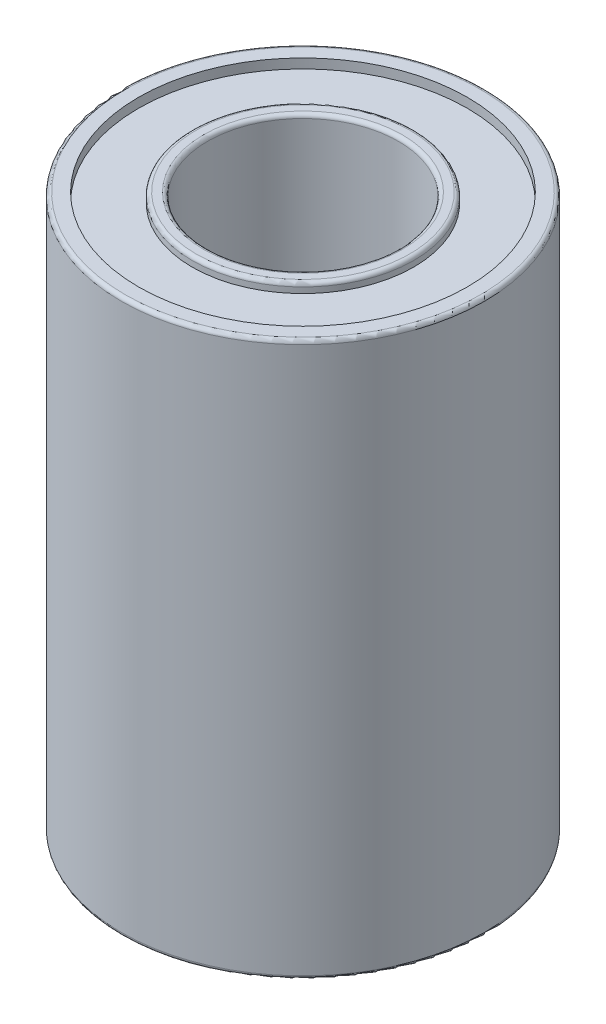
ISO-10303-21;
HEADER;
FILE_DESCRIPTION(('STEP AP214'),'2;1');
FILE_NAME('part.step','',(''),(''),'','','');
FILE_SCHEMA(('AUTOMOTIVE_DESIGN { 1 0 10303 214 1 1 1 1 }'));
ENDSEC;
DATA;
#1=APPLICATION_CONTEXT('core data for automotive mechanical design processes');
#2=APPLICATION_PROTOCOL_DEFINITION('international standard','automotive_design',2000,#1);
#3=PRODUCT_CONTEXT('',#1,'mechanical');
#4=PRODUCT('Part','Part','',(#3));
#5=PRODUCT_RELATED_PRODUCT_CATEGORY('part','',(#4));
#6=PRODUCT_DEFINITION_FORMATION('','',#4);
#7=PRODUCT_DEFINITION_CONTEXT('part definition',#1,'design');
#8=PRODUCT_DEFINITION('design','',#6,#7);
#9=PRODUCT_DEFINITION_SHAPE('','',#8);
#10=(LENGTH_UNIT() NAMED_UNIT(*) SI_UNIT(.MILLI.,.METRE.));
#11=(NAMED_UNIT(*) PLANE_ANGLE_UNIT() SI_UNIT($,.RADIAN.));
#12=(NAMED_UNIT(*) SI_UNIT($,.STERADIAN.) SOLID_ANGLE_UNIT());
#13=UNCERTAINTY_MEASURE_WITH_UNIT(LENGTH_MEASURE(1.E-05),#10,'distance_accuracy_value','');
#14=(GEOMETRIC_REPRESENTATION_CONTEXT(3) GLOBAL_UNCERTAINTY_ASSIGNED_CONTEXT((#13)) GLOBAL_UNIT_ASSIGNED_CONTEXT((#10,
#11,#12)) REPRESENTATION_CONTEXT('',''));
#15=CARTESIAN_POINT('',(0.,0.,0.));
#16=DIRECTION('',(0.,0.,1.));
#17=DIRECTION('',(1.,0.,0.));
#18=AXIS2_PLACEMENT_3D('',#15,#16,#17);
#19=CARTESIAN_POINT('',(0.,0.,0.));
#20=DIRECTION('',(0.,1.,0.));
#21=DIRECTION('',(0.,0.,1.));
#22=AXIS2_PLACEMENT_3D('',#19,#20,#21);
#23=PLANE('',#22);
#24=CARTESIAN_POINT('',(0.,0.,0.));
#25=DIRECTION('',(0.,1.,0.));
#26=DIRECTION('',(0.,0.,1.));
#27=AXIS2_PLACEMENT_3D('',#24,#25,#26);
#28=CIRCLE('',#27,5.2);
#29=CARTESIAN_POINT('',(0.,0.,5.2));
#30=VERTEX_POINT('',#29);
#31=EDGE_CURVE('E67',#30,#30,#28,.T.);
#32=ORIENTED_EDGE('',*,*,#31,.T.);
#33=EDGE_LOOP('',(#32));
#34=FACE_BOUND('',#33,.T.);
#35=CARTESIAN_POINT('',(0.,0.,0.));
#36=DIRECTION('',(0.,1.,0.));
#37=DIRECTION('',(0.,0.,1.));
#38=AXIS2_PLACEMENT_3D('',#35,#36,#37);
#39=CIRCLE('',#38,5.6);
#40=CARTESIAN_POINT('',(0.,0.,5.6));
#41=VERTEX_POINT('',#40);
#42=EDGE_CURVE('E70',#41,#41,#39,.F.);
#43=ORIENTED_EDGE('',*,*,#42,.T.);
#44=EDGE_LOOP('',(#43));
#45=FACE_BOUND('',#44,.T.);
#46=ADVANCED_FACE('F32',(#34,#45),#23,.F.);
#47=CARTESIAN_POINT('',(0.,29.,0.));
#48=DIRECTION('',(0.,1.,0.));
#49=DIRECTION('',(0.,0.,1.));
#50=AXIS2_PLACEMENT_3D('',#47,#48,#49);
#51=PLANE('',#50);
#52=CARTESIAN_POINT('',(0.,29.,0.));
#53=DIRECTION('',(0.,1.,0.));
#54=DIRECTION('',(0.,0.,1.));
#55=AXIS2_PLACEMENT_3D('',#52,#53,#54);
#56=CIRCLE('',#55,5.2);
#57=CARTESIAN_POINT('',(0.,29.,5.2));
#58=VERTEX_POINT('',#57);
#59=EDGE_CURVE('E39',#58,#58,#56,.F.);
#60=ORIENTED_EDGE('',*,*,#59,.T.);
#61=EDGE_LOOP('',(#60));
#62=FACE_BOUND('',#61,.T.);
#63=CARTESIAN_POINT('',(0.,29.,0.));
#64=DIRECTION('',(0.,1.,0.));
#65=DIRECTION('',(0.,0.,1.));
#66=AXIS2_PLACEMENT_3D('',#63,#64,#65);
#67=CIRCLE('',#66,5.6);
#68=CARTESIAN_POINT('',(0.,29.,5.6));
#69=VERTEX_POINT('',#68);
#70=EDGE_CURVE('E43',#69,#69,#67,.T.);
#71=ORIENTED_EDGE('',*,*,#70,.T.);
#72=EDGE_LOOP('',(#71));
#73=FACE_BOUND('',#72,.T.);
#74=ADVANCED_FACE('F118',(#62,#73),#51,.T.);
#75=CARTESIAN_POINT('',(0.,29.,0.));
#76=DIRECTION('',(0.,1.,0.));
#77=DIRECTION('',(0.,0.,1.));
#78=AXIS2_PLACEMENT_3D('',#75,#76,#77);
#79=CIRCLE('',#78,9.3);
#80=CARTESIAN_POINT('',(0.,29.,9.3));
#81=VERTEX_POINT('',#80);
#82=EDGE_CURVE('E79',#81,#81,#79,.T.);
#83=ORIENTED_EDGE('',*,*,#82,.T.);
#84=EDGE_LOOP('',(#83));
#85=FACE_BOUND('',#84,.T.);
#86=CARTESIAN_POINT('',(0.,29.,0.));
#87=DIRECTION('',(0.,1.,0.));
#88=DIRECTION('',(0.,0.,1.));
#89=AXIS2_PLACEMENT_3D('',#86,#87,#88);
#90=CIRCLE('',#89,8.6);
#91=CARTESIAN_POINT('',(0.,29.,8.6));
#92=VERTEX_POINT('',#91);
#93=EDGE_CURVE('E83',#92,#92,#90,.T.);
#94=ORIENTED_EDGE('',*,*,#93,.F.);
#95=EDGE_LOOP('',(#94));
#96=FACE_BOUND('',#95,.T.);
#97=ADVANCED_FACE('F125',(#85,#96),#51,.T.);
#98=CARTESIAN_POINT('',(0.,0.,0.));
#99=DIRECTION('',(0.,1.,0.));
#100=DIRECTION('',(0.,0.,1.));
#101=AXIS2_PLACEMENT_3D('',#98,#99,#100);
#102=CIRCLE('',#101,8.8);
#103=CARTESIAN_POINT('',(0.,0.,8.8));
#104=VERTEX_POINT('',#103);
#105=EDGE_CURVE('E47',#104,#104,#102,.T.);
#106=ORIENTED_EDGE('',*,*,#105,.T.);
#107=EDGE_LOOP('',(#106));
#108=FACE_BOUND('',#107,.T.);
#109=CARTESIAN_POINT('',(0.,0.,0.));
#110=DIRECTION('',(0.,1.,0.));
#111=DIRECTION('',(0.,0.,1.));
#112=AXIS2_PLACEMENT_3D('',#109,#110,#111);
#113=CIRCLE('',#112,9.3);
#114=CARTESIAN_POINT('',(0.,0.,9.3));
#115=VERTEX_POINT('',#114);
#116=EDGE_CURVE('E52',#115,#115,#113,.F.);
#117=ORIENTED_EDGE('',*,*,#116,.T.);
#118=EDGE_LOOP('',(#117));
#119=FACE_BOUND('',#118,.T.);
#120=ADVANCED_FACE('F121',(#108,#119),#23,.F.);
#121=CARTESIAN_POINT('',(0.,29.,0.));
#122=DIRECTION('',(0.,-1.,0.));
#123=DIRECTION('',(0.,0.,-1.));
#124=AXIS2_PLACEMENT_3D('',#121,#122,#123);
#125=CYLINDRICAL_SURFACE('',#124,9.5);
#126=CARTESIAN_POINT('',(0.,28.8,0.));
#127=DIRECTION('',(0.,1.,0.));
#128=DIRECTION('',(0.,0.,1.));
#129=AXIS2_PLACEMENT_3D('',#126,#127,#128);
#130=CIRCLE('',#129,9.5);
#131=CARTESIAN_POINT('',(0.,28.8,9.5));
#132=VERTEX_POINT('',#131);
#133=EDGE_CURVE('E73',#132,#132,#130,.F.);
#134=ORIENTED_EDGE('',*,*,#133,.T.);
#135=EDGE_LOOP('',(#134));
#136=FACE_BOUND('',#135,.T.);
#137=CARTESIAN_POINT('',(0.,0.199999999999999,0.));
#138=DIRECTION('',(0.,1.,0.));
#139=DIRECTION('',(0.,0.,1.));
#140=AXIS2_PLACEMENT_3D('',#137,#138,#139);
#141=CIRCLE('',#140,9.5);
#142=CARTESIAN_POINT('',(0.,0.199999999999999,9.5));
#143=VERTEX_POINT('',#142);
#144=EDGE_CURVE('E76',#143,#143,#141,.T.);
#145=ORIENTED_EDGE('',*,*,#144,.T.);
#146=EDGE_LOOP('',(#145));
#147=FACE_BOUND('',#146,.T.);
#148=ADVANCED_FACE('F130',(#136,#147),#125,.T.);
#149=CARTESIAN_POINT('',(0.,29.,0.));
#150=DIRECTION('',(0.,-1.,0.));
#151=DIRECTION('',(0.,0.,-1.));
#152=AXIS2_PLACEMENT_3D('',#149,#150,#151);
#153=CYLINDRICAL_SURFACE('',#152,5.);
#154=CARTESIAN_POINT('',(0.,0.199999999999999,0.));
#155=DIRECTION('',(0.,1.,0.));
#156=DIRECTION('',(0.,0.,1.));
#157=AXIS2_PLACEMENT_3D('',#154,#155,#156);
#158=CIRCLE('',#157,5.);
#159=CARTESIAN_POINT('',(0.,0.199999999999999,5.));
#160=VERTEX_POINT('',#159);
#161=EDGE_CURVE('E61',#160,#160,#158,.F.);
#162=ORIENTED_EDGE('',*,*,#161,.T.);
#163=EDGE_LOOP('',(#162));
#164=FACE_BOUND('',#163,.T.);
#165=CARTESIAN_POINT('',(0.,28.8,0.));
#166=DIRECTION('',(0.,1.,0.));
#167=DIRECTION('',(0.,0.,1.));
#168=AXIS2_PLACEMENT_3D('',#165,#166,#167);
#169=CIRCLE('',#168,5.);
#170=CARTESIAN_POINT('',(0.,28.8,5.));
#171=VERTEX_POINT('',#170);
#172=EDGE_CURVE('E64',#171,#171,#169,.T.);
#173=ORIENTED_EDGE('',*,*,#172,.T.);
#174=EDGE_LOOP('',(#173));
#175=FACE_BOUND('',#174,.T.);
#176=ADVANCED_FACE('F136',(#164,#175),#153,.F.);
#177=CARTESIAN_POINT('',(0.,28.5,0.));
#178=DIRECTION('',(0.,1.,0.));
#179=DIRECTION('',(0.,0.,1.));
#180=AXIS2_PLACEMENT_3D('',#177,#178,#179);
#181=CYLINDRICAL_SURFACE('',#180,5.8);
#182=CARTESIAN_POINT('',(0.,28.8,0.));
#183=DIRECTION('',(0.,1.,0.));
#184=DIRECTION('',(0.,0.,1.));
#185=AXIS2_PLACEMENT_3D('',#182,#183,#184);
#186=CIRCLE('',#185,5.8);
#187=CARTESIAN_POINT('',(0.,28.8,5.8));
#188=VERTEX_POINT('',#187);
#189=EDGE_CURVE('E10',#188,#188,#186,.F.);
#190=ORIENTED_EDGE('',*,*,#189,.T.);
#191=EDGE_LOOP('',(#190));
#192=FACE_BOUND('',#191,.T.);
#193=CARTESIAN_POINT('',(0.,28.5,0.));
#194=DIRECTION('',(0.,1.,0.));
#195=DIRECTION('',(0.,0.,1.));
#196=AXIS2_PLACEMENT_3D('',#193,#194,#195);
#197=CIRCLE('',#196,5.8);
#198=CARTESIAN_POINT('',(0.,28.5,5.8));
#199=VERTEX_POINT('',#198);
#200=EDGE_CURVE('E86',#199,#199,#197,.T.);
#201=ORIENTED_EDGE('',*,*,#200,.T.);
#202=EDGE_LOOP('',(#201));
#203=FACE_BOUND('',#202,.T.);
#204=ADVANCED_FACE('F182',(#192,#203),#181,.T.);
#205=CARTESIAN_POINT('',(0.,28.5,0.));
#206=DIRECTION('',(0.,1.,0.));
#207=DIRECTION('',(0.,0.,1.));
#208=AXIS2_PLACEMENT_3D('',#205,#206,#207);
#209=CYLINDRICAL_SURFACE('',#208,8.6);
#210=CARTESIAN_POINT('',(0.,28.5,0.));
#211=DIRECTION('',(0.,1.,0.));
#212=DIRECTION('',(0.,0.,1.));
#213=AXIS2_PLACEMENT_3D('',#210,#211,#212);
#214=CIRCLE('',#213,8.6);
#215=CARTESIAN_POINT('',(0.,28.5,8.6));
#216=VERTEX_POINT('',#215);
#217=EDGE_CURVE('E82',#216,#216,#214,.T.);
#218=ORIENTED_EDGE('',*,*,#217,.F.);
#219=EDGE_LOOP('',(#218));
#220=FACE_BOUND('',#219,.T.);
#221=ORIENTED_EDGE('',*,*,#93,.T.);
#222=EDGE_LOOP('',(#221));
#223=FACE_BOUND('',#222,.T.);
#224=ADVANCED_FACE('F114',(#220,#223),#209,.F.);
#225=CARTESIAN_POINT('',(0.,28.5,0.));
#226=DIRECTION('',(0.,1.,0.));
#227=DIRECTION('',(0.,0.,1.));
#228=AXIS2_PLACEMENT_3D('',#225,#226,#227);
#229=PLANE('',#228);
#230=ORIENTED_EDGE('',*,*,#200,.F.);
#231=EDGE_LOOP('',(#230));
#232=FACE_BOUND('',#231,.T.);
#233=ORIENTED_EDGE('',*,*,#217,.T.);
#234=EDGE_LOOP('',(#233));
#235=FACE_BOUND('',#234,.T.);
#236=ADVANCED_FACE('F108',(#232,#235),#229,.T.);
#237=CARTESIAN_POINT('',(0.,0.5,0.));
#238=DIRECTION('',(0.,-1.,0.));
#239=DIRECTION('',(0.,0.,-1.));
#240=AXIS2_PLACEMENT_3D('',#237,#238,#239);
#241=CYLINDRICAL_SURFACE('',#240,8.6);
#242=CARTESIAN_POINT('',(0.,0.2,0.));
#243=DIRECTION('',(0.,1.,0.));
#244=DIRECTION('',(0.,0.,1.));
#245=AXIS2_PLACEMENT_3D('',#242,#243,#244);
#246=CIRCLE('',#245,8.6);
#247=CARTESIAN_POINT('',(0.,0.2,8.6));
#248=VERTEX_POINT('',#247);
#249=EDGE_CURVE('E55',#248,#248,#246,.F.);
#250=ORIENTED_EDGE('',*,*,#249,.T.);
#251=EDGE_LOOP('',(#250));
#252=FACE_BOUND('',#251,.T.);
#253=CARTESIAN_POINT('',(0.,0.5,0.));
#254=DIRECTION('',(0.,-1.,0.));
#255=DIRECTION('',(0.,0.,-1.));
#256=AXIS2_PLACEMENT_3D('',#253,#254,#255);
#257=CIRCLE('',#256,8.6);
#258=CARTESIAN_POINT('',(0.,0.5,-8.6));
#259=VERTEX_POINT('',#258);
#260=EDGE_CURVE('E87',#259,#259,#257,.T.);
#261=ORIENTED_EDGE('',*,*,#260,.F.);
#262=EDGE_LOOP('',(#261));
#263=FACE_BOUND('',#262,.T.);
#264=ADVANCED_FACE('F103',(#252,#263),#241,.F.);
#265=CARTESIAN_POINT('',(0.,0.5,0.));
#266=DIRECTION('',(0.,-1.,0.));
#267=DIRECTION('',(0.,0.,-1.));
#268=AXIS2_PLACEMENT_3D('',#265,#266,#267);
#269=PLANE('',#268);
#270=CARTESIAN_POINT('',(0.,0.5,0.));
#271=DIRECTION('',(0.,-1.,0.));
#272=DIRECTION('',(0.,0.,-1.));
#273=AXIS2_PLACEMENT_3D('',#270,#271,#272);
#274=CIRCLE('',#273,5.8);
#275=CARTESIAN_POINT('',(0.,0.5,-5.8));
#276=VERTEX_POINT('',#275);
#277=EDGE_CURVE('E94',#276,#276,#274,.T.);
#278=ORIENTED_EDGE('',*,*,#277,.F.);
#279=EDGE_LOOP('',(#278));
#280=FACE_BOUND('',#279,.T.);
#281=ORIENTED_EDGE('',*,*,#260,.T.);
#282=EDGE_LOOP('',(#281));
#283=FACE_BOUND('',#282,.T.);
#284=ADVANCED_FACE('F100',(#280,#283),#269,.T.);
#285=CARTESIAN_POINT('',(0.,0.5,0.));
#286=DIRECTION('',(0.,-1.,0.));
#287=DIRECTION('',(0.,0.,-1.));
#288=AXIS2_PLACEMENT_3D('',#285,#286,#287);
#289=CYLINDRICAL_SURFACE('',#288,5.8);
#290=CARTESIAN_POINT('',(0.,0.2,0.));
#291=DIRECTION('',(0.,1.,0.));
#292=DIRECTION('',(0.,0.,1.));
#293=AXIS2_PLACEMENT_3D('',#290,#291,#292);
#294=CIRCLE('',#293,5.8);
#295=CARTESIAN_POINT('',(0.,0.2,5.8));
#296=VERTEX_POINT('',#295);
#297=EDGE_CURVE('E58',#296,#296,#294,.T.);
#298=ORIENTED_EDGE('',*,*,#297,.T.);
#299=EDGE_LOOP('',(#298));
#300=FACE_BOUND('',#299,.T.);
#301=ORIENTED_EDGE('',*,*,#277,.T.);
#302=EDGE_LOOP('',(#301));
#303=FACE_BOUND('',#302,.T.);
#304=ADVANCED_FACE('F98',(#300,#303),#289,.T.);
#305=CARTESIAN_POINT('',(0.,28.8,0.));
#306=DIRECTION('',(0.,1.,0.));
#307=DIRECTION('',(0.,0.,1.));
#308=AXIS2_PLACEMENT_3D('',#305,#306,#307);
#309=TOROIDAL_SURFACE('',#308,9.3,0.2);
#310=ORIENTED_EDGE('',*,*,#133,.F.);
#311=EDGE_LOOP('',(#310));
#312=FACE_BOUND('',#311,.T.);
#313=ORIENTED_EDGE('',*,*,#82,.F.);
#314=EDGE_LOOP('',(#313));
#315=FACE_BOUND('',#314,.T.);
#316=ADVANCED_FACE('F166',(#312,#315),#309,.T.);
#317=CARTESIAN_POINT('',(0.,0.199999999999999,0.));
#318=DIRECTION('',(0.,1.,0.));
#319=DIRECTION('',(0.,0.,1.));
#320=AXIS2_PLACEMENT_3D('',#317,#318,#319);
#321=TOROIDAL_SURFACE('',#320,5.2,0.2);
#322=ORIENTED_EDGE('',*,*,#161,.F.);
#323=EDGE_LOOP('',(#322));
#324=FACE_BOUND('',#323,.T.);
#325=ORIENTED_EDGE('',*,*,#31,.F.);
#326=EDGE_LOOP('',(#325));
#327=FACE_BOUND('',#326,.T.);
#328=ADVANCED_FACE('F162',(#324,#327),#321,.T.);
#329=CARTESIAN_POINT('',(0.,0.2,0.));
#330=DIRECTION('',(0.,1.,0.));
#331=DIRECTION('',(0.,0.,1.));
#332=AXIS2_PLACEMENT_3D('',#329,#330,#331);
#333=TOROIDAL_SURFACE('',#332,5.6,0.2);
#334=ORIENTED_EDGE('',*,*,#297,.F.);
#335=EDGE_LOOP('',(#334));
#336=FACE_BOUND('',#335,.T.);
#337=ORIENTED_EDGE('',*,*,#42,.F.);
#338=EDGE_LOOP('',(#337));
#339=FACE_BOUND('',#338,.T.);
#340=ADVANCED_FACE('F156',(#336,#339),#333,.T.);
#341=CARTESIAN_POINT('',(0.,0.2,0.));
#342=DIRECTION('',(0.,1.,0.));
#343=DIRECTION('',(0.,0.,1.));
#344=AXIS2_PLACEMENT_3D('',#341,#342,#343);
#345=TOROIDAL_SURFACE('',#344,8.8,0.2);
#346=ORIENTED_EDGE('',*,*,#105,.F.);
#347=EDGE_LOOP('',(#346));
#348=FACE_BOUND('',#347,.T.);
#349=ORIENTED_EDGE('',*,*,#249,.F.);
#350=EDGE_LOOP('',(#349));
#351=FACE_BOUND('',#350,.T.);
#352=ADVANCED_FACE('F147',(#348,#351),#345,.T.);
#353=CARTESIAN_POINT('',(0.,0.199999999999999,0.));
#354=DIRECTION('',(0.,1.,0.));
#355=DIRECTION('',(0.,0.,1.));
#356=AXIS2_PLACEMENT_3D('',#353,#354,#355);
#357=TOROIDAL_SURFACE('',#356,9.3,0.2);
#358=ORIENTED_EDGE('',*,*,#116,.F.);
#359=EDGE_LOOP('',(#358));
#360=FACE_BOUND('',#359,.T.);
#361=ORIENTED_EDGE('',*,*,#144,.F.);
#362=EDGE_LOOP('',(#361));
#363=FACE_BOUND('',#362,.T.);
#364=ADVANCED_FACE('F143',(#360,#363),#357,.T.);
#365=CARTESIAN_POINT('',(0.,28.8,0.));
#366=DIRECTION('',(0.,1.,0.));
#367=DIRECTION('',(0.,0.,1.));
#368=AXIS2_PLACEMENT_3D('',#365,#366,#367);
#369=TOROIDAL_SURFACE('',#368,5.2,0.2);
#370=ORIENTED_EDGE('',*,*,#59,.F.);
#371=EDGE_LOOP('',(#370));
#372=FACE_BOUND('',#371,.T.);
#373=ORIENTED_EDGE('',*,*,#172,.F.);
#374=EDGE_LOOP('',(#373));
#375=FACE_BOUND('',#374,.T.);
#376=ADVANCED_FACE('F146',(#372,#375),#369,.T.);
#377=CARTESIAN_POINT('',(0.,28.8,0.));
#378=DIRECTION('',(0.,1.,0.));
#379=DIRECTION('',(0.,0.,1.));
#380=AXIS2_PLACEMENT_3D('',#377,#378,#379);
#381=TOROIDAL_SURFACE('',#380,5.6,0.2);
#382=ORIENTED_EDGE('',*,*,#189,.F.);
#383=EDGE_LOOP('',(#382));
#384=FACE_BOUND('',#383,.T.);
#385=ORIENTED_EDGE('',*,*,#70,.F.);
#386=EDGE_LOOP('',(#385));
#387=FACE_BOUND('',#386,.T.);
#388=ADVANCED_FACE('F34',(#384,#387),#381,.T.);
#389=CLOSED_SHELL('',(#46,#74,#97,#120,#148,#176,#204,#224,#236,#264,#284,#304,#316,#328,#340,
#352,#364,#376,#388));
#390=MANIFOLD_SOLID_BREP('B2',#389);
#391=ADVANCED_BREP_SHAPE_REPRESENTATION('',(#18,#390),#14);
#392=SHAPE_DEFINITION_REPRESENTATION(#9,#391);
ENDSEC;
END-ISO-10303-21;
